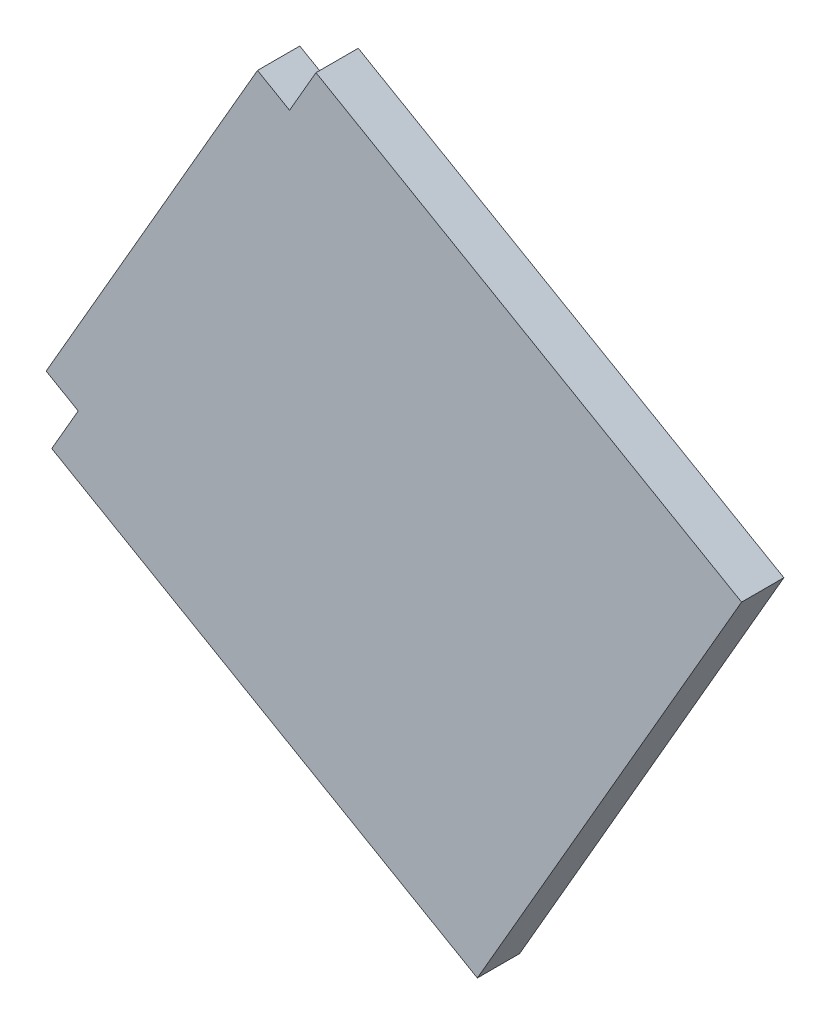
ISO-10303-21;
HEADER;
FILE_DESCRIPTION(('STEP AP214'),'2;1');
FILE_NAME('part.step','',(''),(''),'','','');
FILE_SCHEMA(('AUTOMOTIVE_DESIGN { 1 0 10303 214 1 1 1 1 }'));
ENDSEC;
DATA;
#1=APPLICATION_CONTEXT('core data for automotive mechanical design processes');
#2=APPLICATION_PROTOCOL_DEFINITION('international standard','automotive_design',2000,#1);
#3=PRODUCT_CONTEXT('',#1,'mechanical');
#4=PRODUCT('Part','Part','',(#3));
#5=PRODUCT_RELATED_PRODUCT_CATEGORY('part','',(#4));
#6=PRODUCT_DEFINITION_FORMATION('','',#4);
#7=PRODUCT_DEFINITION_CONTEXT('part definition',#1,'design');
#8=PRODUCT_DEFINITION('design','',#6,#7);
#9=PRODUCT_DEFINITION_SHAPE('','',#8);
#10=(LENGTH_UNIT() NAMED_UNIT(*) SI_UNIT(.MILLI.,.METRE.));
#11=(NAMED_UNIT(*) PLANE_ANGLE_UNIT() SI_UNIT($,.RADIAN.));
#12=(NAMED_UNIT(*) SI_UNIT($,.STERADIAN.) SOLID_ANGLE_UNIT());
#13=UNCERTAINTY_MEASURE_WITH_UNIT(LENGTH_MEASURE(1.E-05),#10,'distance_accuracy_value','');
#14=(GEOMETRIC_REPRESENTATION_CONTEXT(3) GLOBAL_UNCERTAINTY_ASSIGNED_CONTEXT((#13)) GLOBAL_UNIT_ASSIGNED_CONTEXT((#10,
#11,#12)) REPRESENTATION_CONTEXT('',''));
#15=CARTESIAN_POINT('',(0.,0.,0.));
#16=DIRECTION('',(0.,0.,1.));
#17=DIRECTION('',(1.,0.,0.));
#18=AXIS2_PLACEMENT_3D('',#15,#16,#17);
#19=CARTESIAN_POINT('',(0.199999999999999,0.346410161513775,0.));
#20=DIRECTION('',(-0.499999999999999,-0.866025403784439,0.));
#21=DIRECTION('',(0.866025403784439,-0.499999999999999,0.));
#22=AXIS2_PLACEMENT_3D('',#19,#20,#21);
#23=PLANE('',#22);
#24=DIRECTION('',(0.866025403784439,-0.499999999999999,0.));
#25=VECTOR('',#24,1.);
#26=CARTESIAN_POINT('',(0.199999999999999,0.346410161513775,0.08));
#27=LINE('',#26,#25);
#28=CARTESIAN_POINT('',(0.95,-0.0866025403784438,0.08));
#29=VERTEX_POINT('',#28);
#30=CARTESIAN_POINT('',(1.01062177826491,-0.121602540378444,0.08));
#31=VERTEX_POINT('',#30);
#32=EDGE_CURVE('E132',#29,#31,#27,.T.);
#33=ORIENTED_EDGE('',*,*,#32,.T.);
#34=DIRECTION('',(0.,0.,1.));
#35=VECTOR('',#34,1.);
#36=CARTESIAN_POINT('',(1.01062177826491,-0.121602540378444,0.));
#37=LINE('',#36,#35);
#38=CARTESIAN_POINT('',(1.01062177826491,-0.121602540378444,0.));
#39=VERTEX_POINT('',#38);
#40=EDGE_CURVE('E11',#39,#31,#37,.T.);
#41=ORIENTED_EDGE('',*,*,#40,.F.);
#42=DIRECTION('',(0.866025403784439,-0.499999999999999,0.));
#43=VECTOR('',#42,1.);
#44=CARTESIAN_POINT('',(0.199999999999999,0.346410161513775,0.));
#45=LINE('',#44,#43);
#46=CARTESIAN_POINT('',(0.95,-0.0866025403784438,0.));
#47=VERTEX_POINT('',#46);
#48=EDGE_CURVE('E53',#47,#39,#45,.T.);
#49=ORIENTED_EDGE('',*,*,#48,.F.);
#50=DIRECTION('',(0.,0.,1.));
#51=VECTOR('',#50,1.);
#52=CARTESIAN_POINT('',(0.95,-0.0866025403784438,0.));
#53=LINE('',#52,#51);
#54=EDGE_CURVE('E38',#47,#29,#53,.T.);
#55=ORIENTED_EDGE('',*,*,#54,.T.);
#56=EDGE_LOOP('',(#33,#41,#49,#55));
#57=FACE_BOUND('',#56,.T.);
#58=ADVANCED_FACE('F35',(#57),#23,.F.);
#59=CARTESIAN_POINT('',(0.810621778264911,-0.468012701892219,0.));
#60=DIRECTION('',(-0.866025403784439,0.499999999999999,0.));
#61=DIRECTION('',(-0.499999999999999,-0.866025403784439,0.));
#62=AXIS2_PLACEMENT_3D('',#59,#60,#61);
#63=PLANE('',#62);
#64=DIRECTION('',(-0.499999999999999,-0.866025403784439,0.));
#65=VECTOR('',#64,1.);
#66=CARTESIAN_POINT('',(0.810621778264911,-0.468012701892219,0.08));
#67=LINE('',#66,#65);
#68=CARTESIAN_POINT('',(1.06062177826491,-0.0349999999999999,0.08));
#69=VERTEX_POINT('',#68);
#70=EDGE_CURVE('E148',#69,#31,#67,.T.);
#71=ORIENTED_EDGE('',*,*,#70,.F.);
#72=DIRECTION('',(0.,0.,1.));
#73=VECTOR('',#72,1.);
#74=CARTESIAN_POINT('',(1.06062177826491,-0.0349999999999999,0.));
#75=LINE('',#74,#73);
#76=CARTESIAN_POINT('',(1.06062177826491,-0.0349999999999999,0.));
#77=VERTEX_POINT('',#76);
#78=EDGE_CURVE('E44',#77,#69,#75,.T.);
#79=ORIENTED_EDGE('',*,*,#78,.F.);
#80=DIRECTION('',(-0.499999999999999,-0.866025403784439,0.));
#81=VECTOR('',#80,1.);
#82=CARTESIAN_POINT('',(0.810621778264911,-0.468012701892219,0.));
#83=LINE('',#82,#81);
#84=EDGE_CURVE('E112',#77,#39,#83,.T.);
#85=ORIENTED_EDGE('',*,*,#84,.T.);
#86=ORIENTED_EDGE('',*,*,#40,.T.);
#87=EDGE_LOOP('',(#71,#79,#85,#86));
#88=FACE_BOUND('',#87,.T.);
#89=ADVANCED_FACE('F165',(#88),#63,.T.);
#90=CARTESIAN_POINT('',(0.25,0.433012701892219,0.));
#91=DIRECTION('',(-0.5,-0.866025403784439,0.));
#92=DIRECTION('',(0.866025403784439,-0.5,0.));
#93=AXIS2_PLACEMENT_3D('',#90,#91,#92);
#94=PLANE('',#93);
#95=DIRECTION('',(0.866025403784439,-0.5,0.));
#96=VECTOR('',#95,1.);
#97=CARTESIAN_POINT('',(0.25,0.433012701892219,0.08));
#98=LINE('',#97,#96);
#99=CARTESIAN_POINT('',(1.86602540378444,-0.499999999999999,0.08));
#100=VERTEX_POINT('',#99);
#101=EDGE_CURVE('E117',#69,#100,#98,.T.);
#102=ORIENTED_EDGE('',*,*,#101,.T.);
#103=DIRECTION('',(0.,0.,1.));
#104=VECTOR('',#103,1.);
#105=CARTESIAN_POINT('',(1.86602540378444,-0.499999999999999,0.));
#106=LINE('',#105,#104);
#107=CARTESIAN_POINT('',(1.86602540378444,-0.499999999999999,0.));
#108=VERTEX_POINT('',#107);
#109=EDGE_CURVE('E115',#108,#100,#106,.T.);
#110=ORIENTED_EDGE('',*,*,#109,.F.);
#111=DIRECTION('',(0.866025403784439,-0.5,0.));
#112=VECTOR('',#111,1.);
#113=CARTESIAN_POINT('',(0.25,0.433012701892219,0.));
#114=LINE('',#113,#112);
#115=EDGE_CURVE('E105',#77,#108,#114,.T.);
#116=ORIENTED_EDGE('',*,*,#115,.F.);
#117=ORIENTED_EDGE('',*,*,#78,.T.);
#118=EDGE_LOOP('',(#102,#110,#116,#117));
#119=FACE_BOUND('',#118,.T.);
#120=ADVANCED_FACE('F116',(#119),#94,.F.);
#121=CARTESIAN_POINT('',(1.61602540378444,-0.933012701892219,0.));
#122=DIRECTION('',(-0.866025403784439,0.5,0.));
#123=DIRECTION('',(-0.5,-0.866025403784439,0.));
#124=AXIS2_PLACEMENT_3D('',#121,#122,#123);
#125=PLANE('',#124);
#126=DIRECTION('',(-0.5,-0.866025403784439,0.));
#127=VECTOR('',#126,1.);
#128=CARTESIAN_POINT('',(1.61602540378444,-0.933012701892219,0.08));
#129=LINE('',#128,#127);
#130=CARTESIAN_POINT('',(1.36602540378444,-1.36602540378444,0.08));
#131=VERTEX_POINT('',#130);
#132=EDGE_CURVE('E145',#100,#131,#129,.T.);
#133=ORIENTED_EDGE('',*,*,#132,.T.);
#134=DIRECTION('',(0.,0.,1.));
#135=VECTOR('',#134,1.);
#136=CARTESIAN_POINT('',(1.36602540378444,-1.36602540378444,0.));
#137=LINE('',#136,#135);
#138=CARTESIAN_POINT('',(1.36602540378444,-1.36602540378444,0.));
#139=VERTEX_POINT('',#138);
#140=EDGE_CURVE('E121',#139,#131,#137,.T.);
#141=ORIENTED_EDGE('',*,*,#140,.F.);
#142=DIRECTION('',(-0.5,-0.866025403784439,0.));
#143=VECTOR('',#142,1.);
#144=CARTESIAN_POINT('',(1.61602540378444,-0.933012701892219,0.));
#145=LINE('',#144,#143);
#146=EDGE_CURVE('E110',#108,#139,#145,.T.);
#147=ORIENTED_EDGE('',*,*,#146,.F.);
#148=ORIENTED_EDGE('',*,*,#109,.T.);
#149=EDGE_LOOP('',(#133,#141,#147,#148));
#150=FACE_BOUND('',#149,.T.);
#151=ADVANCED_FACE('F123',(#150),#125,.F.);
#152=CARTESIAN_POINT('',(-0.25,-0.43301270189222,0.));
#153=DIRECTION('',(-0.499999999999999,-0.866025403784439,0.));
#154=DIRECTION('',(0.866025403784439,-0.499999999999999,0.));
#155=AXIS2_PLACEMENT_3D('',#152,#153,#154);
#156=PLANE('',#155);
#157=DIRECTION('',(0.866025403784439,-0.499999999999999,0.));
#158=VECTOR('',#157,1.);
#159=CARTESIAN_POINT('',(-0.25,-0.43301270189222,0.08));
#160=LINE('',#159,#158);
#161=CARTESIAN_POINT('',(0.560621778264911,-0.901025403784439,0.08));
#162=VERTEX_POINT('',#161);
#163=EDGE_CURVE('E142',#162,#131,#160,.T.);
#164=ORIENTED_EDGE('',*,*,#163,.F.);
#165=DIRECTION('',(0.,0.,1.));
#166=VECTOR('',#165,1.);
#167=CARTESIAN_POINT('',(0.560621778264911,-0.901025403784439,0.));
#168=LINE('',#167,#166);
#169=CARTESIAN_POINT('',(0.560621778264911,-0.901025403784439,0.));
#170=VERTEX_POINT('',#169);
#171=EDGE_CURVE('E153',#170,#162,#168,.T.);
#172=ORIENTED_EDGE('',*,*,#171,.F.);
#173=DIRECTION('',(0.866025403784439,-0.499999999999999,0.));
#174=VECTOR('',#173,1.);
#175=CARTESIAN_POINT('',(-0.25,-0.43301270189222,0.));
#176=LINE('',#175,#174);
#177=EDGE_CURVE('E125',#170,#139,#176,.T.);
#178=ORIENTED_EDGE('',*,*,#177,.T.);
#179=ORIENTED_EDGE('',*,*,#140,.T.);
#180=EDGE_LOOP('',(#164,#172,#178,#179));
#181=FACE_BOUND('',#180,.T.);
#182=ADVANCED_FACE('F178',(#181),#156,.T.);
#183=CARTESIAN_POINT('',(0.810621778264911,-0.468012701892218,0.));
#184=DIRECTION('',(0.866025403784439,-0.499999999999999,0.));
#185=DIRECTION('',(0.499999999999999,0.866025403784439,0.));
#186=AXIS2_PLACEMENT_3D('',#183,#184,#185);
#187=PLANE('',#186);
#188=DIRECTION('',(0.499999999999999,0.866025403784439,0.));
#189=VECTOR('',#188,1.);
#190=CARTESIAN_POINT('',(0.810621778264911,-0.468012701892218,0.08));
#191=LINE('',#190,#189);
#192=CARTESIAN_POINT('',(0.610621778264911,-0.814422863405994,0.08));
#193=VERTEX_POINT('',#192);
#194=EDGE_CURVE('E139',#162,#193,#191,.T.);
#195=ORIENTED_EDGE('',*,*,#194,.T.);
#196=DIRECTION('',(0.,0.,1.));
#197=VECTOR('',#196,1.);
#198=CARTESIAN_POINT('',(0.610621778264911,-0.814422863405994,0.));
#199=LINE('',#198,#197);
#200=CARTESIAN_POINT('',(0.610621778264911,-0.814422863405994,0.));
#201=VERTEX_POINT('',#200);
#202=EDGE_CURVE('E155',#201,#193,#199,.T.);
#203=ORIENTED_EDGE('',*,*,#202,.F.);
#204=DIRECTION('',(0.499999999999999,0.866025403784439,0.));
#205=VECTOR('',#204,1.);
#206=CARTESIAN_POINT('',(0.810621778264911,-0.468012701892218,0.));
#207=LINE('',#206,#205);
#208=EDGE_CURVE('E127',#170,#201,#207,.T.);
#209=ORIENTED_EDGE('',*,*,#208,.F.);
#210=ORIENTED_EDGE('',*,*,#171,.T.);
#211=EDGE_LOOP('',(#195,#203,#209,#210));
#212=FACE_BOUND('',#211,.T.);
#213=ADVANCED_FACE('F181',(#212),#187,.F.);
#214=CARTESIAN_POINT('',(-0.2,-0.346410161513775,0.));
#215=DIRECTION('',(-0.5,-0.866025403784439,0.));
#216=DIRECTION('',(0.866025403784439,-0.5,0.));
#217=AXIS2_PLACEMENT_3D('',#214,#215,#216);
#218=PLANE('',#217);
#219=DIRECTION('',(0.866025403784439,-0.5,0.));
#220=VECTOR('',#219,1.);
#221=CARTESIAN_POINT('',(-0.2,-0.346410161513775,0.08));
#222=LINE('',#221,#220);
#223=CARTESIAN_POINT('',(0.55,-0.779422863405995,0.08));
#224=VERTEX_POINT('',#223);
#225=EDGE_CURVE('E136',#224,#193,#222,.T.);
#226=ORIENTED_EDGE('',*,*,#225,.F.);
#227=DIRECTION('',(0.,0.,1.));
#228=VECTOR('',#227,1.);
#229=CARTESIAN_POINT('',(0.55,-0.779422863405995,0.));
#230=LINE('',#229,#228);
#231=CARTESIAN_POINT('',(0.55,-0.779422863405995,0.));
#232=VERTEX_POINT('',#231);
#233=EDGE_CURVE('E156',#232,#224,#230,.T.);
#234=ORIENTED_EDGE('',*,*,#233,.F.);
#235=DIRECTION('',(0.866025403784439,-0.5,0.));
#236=VECTOR('',#235,1.);
#237=CARTESIAN_POINT('',(-0.2,-0.346410161513775,0.));
#238=LINE('',#237,#236);
#239=EDGE_CURVE('E259',#232,#201,#238,.T.);
#240=ORIENTED_EDGE('',*,*,#239,.T.);
#241=ORIENTED_EDGE('',*,*,#202,.T.);
#242=EDGE_LOOP('',(#226,#234,#240,#241));
#243=FACE_BOUND('',#242,.T.);
#244=ADVANCED_FACE('F185',(#243),#218,.T.);
#245=CARTESIAN_POINT('',(0.75,-0.433012701892219,0.));
#246=DIRECTION('',(0.866025403784439,-0.5,0.));
#247=DIRECTION('',(0.5,0.866025403784439,0.));
#248=AXIS2_PLACEMENT_3D('',#245,#246,#247);
#249=PLANE('',#248);
#250=DIRECTION('',(0.5,0.866025403784439,0.));
#251=VECTOR('',#250,1.);
#252=CARTESIAN_POINT('',(0.75,-0.433012701892219,0.08));
#253=LINE('',#252,#251);
#254=EDGE_CURVE('E134',#224,#29,#253,.T.);
#255=ORIENTED_EDGE('',*,*,#254,.T.);
#256=ORIENTED_EDGE('',*,*,#54,.F.);
#257=DIRECTION('',(0.5,0.866025403784439,0.));
#258=VECTOR('',#257,1.);
#259=CARTESIAN_POINT('',(0.75,-0.433012701892219,0.));
#260=LINE('',#259,#258);
#261=EDGE_CURVE('E91',#232,#47,#260,.T.);
#262=ORIENTED_EDGE('',*,*,#261,.F.);
#263=ORIENTED_EDGE('',*,*,#233,.T.);
#264=EDGE_LOOP('',(#255,#256,#262,#263));
#265=FACE_BOUND('',#264,.T.);
#266=ADVANCED_FACE('F188',(#265),#249,.F.);
#267=CARTESIAN_POINT('',(0.,0.,0.));
#268=DIRECTION('',(0.,0.,1.));
#269=DIRECTION('',(1.,0.,0.));
#270=AXIS2_PLACEMENT_3D('',#267,#268,#269);
#271=PLANE('',#270);
#272=ORIENTED_EDGE('',*,*,#48,.T.);
#273=ORIENTED_EDGE('',*,*,#84,.F.);
#274=ORIENTED_EDGE('',*,*,#115,.T.);
#275=ORIENTED_EDGE('',*,*,#146,.T.);
#276=ORIENTED_EDGE('',*,*,#177,.F.);
#277=ORIENTED_EDGE('',*,*,#208,.T.);
#278=ORIENTED_EDGE('',*,*,#239,.F.);
#279=ORIENTED_EDGE('',*,*,#261,.T.);
#280=EDGE_LOOP('',(#272,#273,#274,#275,#276,#277,#278,#279));
#281=FACE_BOUND('',#280,.T.);
#282=ADVANCED_FACE('F107',(#281),#271,.F.);
#283=CARTESIAN_POINT('',(0.,0.,0.08));
#284=DIRECTION('',(0.,0.,1.));
#285=DIRECTION('',(1.,0.,0.));
#286=AXIS2_PLACEMENT_3D('',#283,#284,#285);
#287=PLANE('',#286);
#288=ORIENTED_EDGE('',*,*,#32,.F.);
#289=ORIENTED_EDGE('',*,*,#254,.F.);
#290=ORIENTED_EDGE('',*,*,#225,.T.);
#291=ORIENTED_EDGE('',*,*,#194,.F.);
#292=ORIENTED_EDGE('',*,*,#163,.T.);
#293=ORIENTED_EDGE('',*,*,#132,.F.);
#294=ORIENTED_EDGE('',*,*,#101,.F.);
#295=ORIENTED_EDGE('',*,*,#70,.T.);
#296=EDGE_LOOP('',(#288,#289,#290,#291,#292,#293,#294,#295));
#297=FACE_BOUND('',#296,.T.);
#298=ADVANCED_FACE('F163',(#297),#287,.T.);
#299=CLOSED_SHELL('',(#58,#89,#120,#151,#182,#213,#244,#266,#282,#298));
#300=MANIFOLD_SOLID_BREP('B2',#299);
#301=ADVANCED_BREP_SHAPE_REPRESENTATION('',(#18,#300),#14);
#302=SHAPE_DEFINITION_REPRESENTATION(#9,#301);
ENDSEC;
END-ISO-10303-21;
